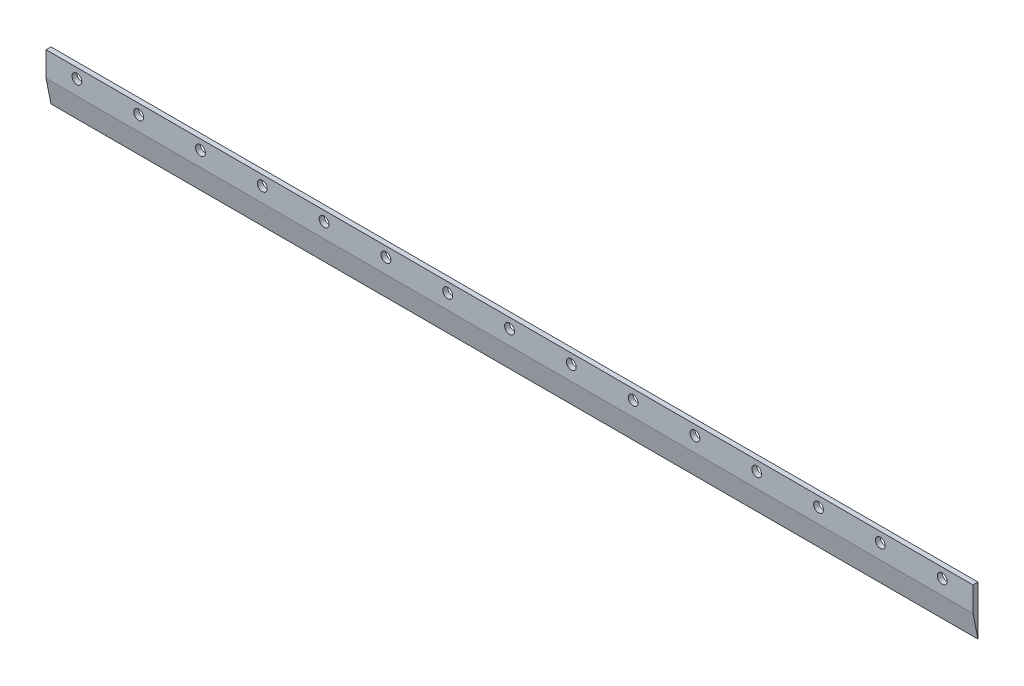
ISO-10303-21;
HEADER;
FILE_DESCRIPTION(('STEP AP214'),'2;1');
FILE_NAME('part.step','',(''),(''),'','','');
FILE_SCHEMA(('AUTOMOTIVE_DESIGN { 1 0 10303 214 1 1 1 1 }'));
ENDSEC;
DATA;
#1=APPLICATION_CONTEXT('core data for automotive mechanical design processes');
#2=APPLICATION_PROTOCOL_DEFINITION('international standard','automotive_design',2000,#1);
#3=PRODUCT_CONTEXT('',#1,'mechanical');
#4=PRODUCT('Part','Part','',(#3));
#5=PRODUCT_RELATED_PRODUCT_CATEGORY('part','',(#4));
#6=PRODUCT_DEFINITION_FORMATION('','',#4);
#7=PRODUCT_DEFINITION_CONTEXT('part definition',#1,'design');
#8=PRODUCT_DEFINITION('design','',#6,#7);
#9=PRODUCT_DEFINITION_SHAPE('','',#8);
#10=(LENGTH_UNIT() NAMED_UNIT(*) SI_UNIT(.MILLI.,.METRE.));
#11=(NAMED_UNIT(*) PLANE_ANGLE_UNIT() SI_UNIT($,.RADIAN.));
#12=(NAMED_UNIT(*) SI_UNIT($,.STERADIAN.) SOLID_ANGLE_UNIT());
#13=UNCERTAINTY_MEASURE_WITH_UNIT(LENGTH_MEASURE(1.E-05),#10,'distance_accuracy_value','');
#14=(GEOMETRIC_REPRESENTATION_CONTEXT(3) GLOBAL_UNCERTAINTY_ASSIGNED_CONTEXT((#13)) GLOBAL_UNIT_ASSIGNED_CONTEXT((#10,
#11,#12)) REPRESENTATION_CONTEXT('',''));
#15=CARTESIAN_POINT('',(0.,0.,0.));
#16=DIRECTION('',(0.,0.,1.));
#17=DIRECTION('',(1.,0.,0.));
#18=AXIS2_PLACEMENT_3D('',#15,#16,#17);
#19=CARTESIAN_POINT('',(375.,-20.,4.));
#20=DIRECTION('',(-1.,0.,0.));
#21=DIRECTION('',(0.,0.,1.));
#22=AXIS2_PLACEMENT_3D('',#19,#20,#21);
#23=PLANE('',#22);
#24=DIRECTION('',(0.,1.,0.));
#25=VECTOR('',#24,1.);
#26=CARTESIAN_POINT('',(375.,-20.,4.));
#27=LINE('',#26,#25);
#28=CARTESIAN_POINT('',(375.,0.,4.));
#29=VERTEX_POINT('',#28);
#30=CARTESIAN_POINT('',(375.,20.,4.));
#31=VERTEX_POINT('',#30);
#32=EDGE_CURVE('E91',#29,#31,#27,.T.);
#33=ORIENTED_EDGE('',*,*,#32,.F.);
#34=DIRECTION('',(0.,0.98058067569092,0.196116135138184));
#35=VECTOR('',#34,1.);
#36=CARTESIAN_POINT('',(375.,-0.769230769230769,3.84615384615385));
#37=LINE('',#36,#35);
#38=CARTESIAN_POINT('',(375.,-20.,0.));
#39=VERTEX_POINT('',#38);
#40=EDGE_CURVE('E80',#39,#29,#37,.T.);
#41=ORIENTED_EDGE('',*,*,#40,.F.);
#42=DIRECTION('',(0.,1.,0.));
#43=VECTOR('',#42,1.);
#44=CARTESIAN_POINT('',(375.,-20.,0.));
#45=LINE('',#44,#43);
#46=CARTESIAN_POINT('',(375.,20.,0.));
#47=VERTEX_POINT('',#46);
#48=EDGE_CURVE('E90',#39,#47,#45,.T.);
#49=ORIENTED_EDGE('',*,*,#48,.T.);
#50=DIRECTION('',(0.,0.,-1.));
#51=VECTOR('',#50,1.);
#52=CARTESIAN_POINT('',(375.,20.,4.));
#53=LINE('',#52,#51);
#54=EDGE_CURVE('E11',#31,#47,#53,.T.);
#55=ORIENTED_EDGE('',*,*,#54,.F.);
#56=EDGE_LOOP('',(#33,#41,#49,#55));
#57=FACE_BOUND('',#56,.T.);
#58=ADVANCED_FACE('F34',(#57),#23,.F.);
#59=CARTESIAN_POINT('',(-375.,20.,4.));
#60=DIRECTION('',(0.,-1.,0.));
#61=DIRECTION('',(0.,0.,-1.));
#62=AXIS2_PLACEMENT_3D('',#59,#60,#61);
#63=PLANE('',#62);
#64=DIRECTION('',(-1.,0.,0.));
#65=VECTOR('',#64,1.);
#66=CARTESIAN_POINT('',(-375.,20.,0.));
#67=LINE('',#66,#65);
#68=CARTESIAN_POINT('',(-375.,20.,0.));
#69=VERTEX_POINT('',#68);
#70=EDGE_CURVE('E61',#47,#69,#67,.T.);
#71=ORIENTED_EDGE('',*,*,#70,.T.);
#72=DIRECTION('',(0.,0.,-1.));
#73=VECTOR('',#72,1.);
#74=CARTESIAN_POINT('',(-375.,20.,4.));
#75=LINE('',#74,#73);
#76=CARTESIAN_POINT('',(-375.,20.,4.));
#77=VERTEX_POINT('',#76);
#78=EDGE_CURVE('E42',#77,#69,#75,.T.);
#79=ORIENTED_EDGE('',*,*,#78,.F.);
#80=DIRECTION('',(-1.,0.,0.));
#81=VECTOR('',#80,1.);
#82=CARTESIAN_POINT('',(-375.,20.,4.));
#83=LINE('',#82,#81);
#84=EDGE_CURVE('E50',#31,#77,#83,.T.);
#85=ORIENTED_EDGE('',*,*,#84,.F.);
#86=ORIENTED_EDGE('',*,*,#54,.T.);
#87=EDGE_LOOP('',(#71,#79,#85,#86));
#88=FACE_BOUND('',#87,.T.);
#89=ADVANCED_FACE('F245',(#88),#63,.F.);
#90=CARTESIAN_POINT('',(-375.,-20.,4.));
#91=DIRECTION('',(1.,0.,0.));
#92=DIRECTION('',(0.,0.,-1.));
#93=AXIS2_PLACEMENT_3D('',#90,#91,#92);
#94=PLANE('',#93);
#95=DIRECTION('',(0.,-1.,0.));
#96=VECTOR('',#95,1.);
#97=CARTESIAN_POINT('',(-375.,-20.,0.));
#98=LINE('',#97,#96);
#99=CARTESIAN_POINT('',(-375.,-20.,0.));
#100=VERTEX_POINT('',#99);
#101=EDGE_CURVE('E83',#69,#100,#98,.T.);
#102=ORIENTED_EDGE('',*,*,#101,.T.);
#103=DIRECTION('',(0.,0.98058067569092,0.196116135138184));
#104=VECTOR('',#103,1.);
#105=CARTESIAN_POINT('',(-375.,-0.769230769230769,3.84615384615385));
#106=LINE('',#105,#104);
#107=CARTESIAN_POINT('',(-375.,0.,4.));
#108=VERTEX_POINT('',#107);
#109=EDGE_CURVE('E68',#100,#108,#106,.T.);
#110=ORIENTED_EDGE('',*,*,#109,.T.);
#111=DIRECTION('',(0.,-1.,0.));
#112=VECTOR('',#111,1.);
#113=CARTESIAN_POINT('',(-375.,-20.,4.));
#114=LINE('',#113,#112);
#115=EDGE_CURVE('E95',#77,#108,#114,.T.);
#116=ORIENTED_EDGE('',*,*,#115,.F.);
#117=ORIENTED_EDGE('',*,*,#78,.T.);
#118=EDGE_LOOP('',(#102,#110,#116,#117));
#119=FACE_BOUND('',#118,.T.);
#120=ADVANCED_FACE('F84',(#119),#94,.F.);
#121=CARTESIAN_POINT('',(0.,0.,4.));
#122=DIRECTION('',(0.,0.,-1.));
#123=DIRECTION('',(-1.,0.,0.));
#124=AXIS2_PLACEMENT_3D('',#121,#122,#123);
#125=PLANE('',#124);
#126=CARTESIAN_POINT('',(350.,11.9999999999999,4.));
#127=DIRECTION('',(0.,0.,-1.));
#128=DIRECTION('',(-1.,0.,0.));
#129=AXIS2_PLACEMENT_3D('',#126,#127,#128);
#130=CIRCLE('',#129,3.96875000000005);
#131=CARTESIAN_POINT('',(346.03125,11.9999999999999,4.));
#132=VERTEX_POINT('',#131);
#133=EDGE_CURVE('E105',#132,#132,#130,.T.);
#134=ORIENTED_EDGE('',*,*,#133,.T.);
#135=EDGE_LOOP('',(#134));
#136=FACE_BOUND('',#135,.T.);
#137=CARTESIAN_POINT('',(300.,11.9999999999999,4.));
#138=DIRECTION('',(0.,0.,-1.));
#139=DIRECTION('',(-1.,0.,0.));
#140=AXIS2_PLACEMENT_3D('',#137,#138,#139);
#141=CIRCLE('',#140,3.96875000000005);
#142=CARTESIAN_POINT('',(296.03125,11.9999999999999,4.));
#143=VERTEX_POINT('',#142);
#144=EDGE_CURVE('E109',#143,#143,#141,.T.);
#145=ORIENTED_EDGE('',*,*,#144,.T.);
#146=EDGE_LOOP('',(#145));
#147=FACE_BOUND('',#146,.T.);
#148=CARTESIAN_POINT('',(250.,11.9999999999999,4.));
#149=DIRECTION('',(0.,0.,-1.));
#150=DIRECTION('',(-1.,0.,0.));
#151=AXIS2_PLACEMENT_3D('',#148,#149,#150);
#152=CIRCLE('',#151,3.96875000000005);
#153=CARTESIAN_POINT('',(246.03125,11.9999999999999,4.));
#154=VERTEX_POINT('',#153);
#155=EDGE_CURVE('E112',#154,#154,#152,.T.);
#156=ORIENTED_EDGE('',*,*,#155,.T.);
#157=EDGE_LOOP('',(#156));
#158=FACE_BOUND('',#157,.T.);
#159=CARTESIAN_POINT('',(200.,11.9999999999999,4.));
#160=DIRECTION('',(0.,0.,-1.));
#161=DIRECTION('',(-1.,0.,0.));
#162=AXIS2_PLACEMENT_3D('',#159,#160,#161);
#163=CIRCLE('',#162,3.96875000000005);
#164=CARTESIAN_POINT('',(196.03125,11.9999999999999,4.));
#165=VERTEX_POINT('',#164);
#166=EDGE_CURVE('E115',#165,#165,#163,.T.);
#167=ORIENTED_EDGE('',*,*,#166,.T.);
#168=EDGE_LOOP('',(#167));
#169=FACE_BOUND('',#168,.T.);
#170=CARTESIAN_POINT('',(150.,11.9999999999999,4.));
#171=DIRECTION('',(0.,0.,-1.));
#172=DIRECTION('',(-1.,0.,0.));
#173=AXIS2_PLACEMENT_3D('',#170,#171,#172);
#174=CIRCLE('',#173,3.96875000000005);
#175=CARTESIAN_POINT('',(146.03125,11.9999999999999,4.));
#176=VERTEX_POINT('',#175);
#177=EDGE_CURVE('E118',#176,#176,#174,.T.);
#178=ORIENTED_EDGE('',*,*,#177,.T.);
#179=EDGE_LOOP('',(#178));
#180=FACE_BOUND('',#179,.T.);
#181=CARTESIAN_POINT('',(100.,11.9999999999999,4.));
#182=DIRECTION('',(0.,0.,-1.));
#183=DIRECTION('',(-1.,0.,0.));
#184=AXIS2_PLACEMENT_3D('',#181,#182,#183);
#185=CIRCLE('',#184,3.96875000000005);
#186=CARTESIAN_POINT('',(96.0312499999999,11.9999999999999,4.));
#187=VERTEX_POINT('',#186);
#188=EDGE_CURVE('E121',#187,#187,#185,.T.);
#189=ORIENTED_EDGE('',*,*,#188,.T.);
#190=EDGE_LOOP('',(#189));
#191=FACE_BOUND('',#190,.T.);
#192=CARTESIAN_POINT('',(50.,11.9999999999999,4.));
#193=DIRECTION('',(0.,0.,-1.));
#194=DIRECTION('',(-1.,0.,0.));
#195=AXIS2_PLACEMENT_3D('',#192,#193,#194);
#196=CIRCLE('',#195,3.96875000000004);
#197=CARTESIAN_POINT('',(46.03125,11.9999999999999,4.));
#198=VERTEX_POINT('',#197);
#199=EDGE_CURVE('E124',#198,#198,#196,.T.);
#200=ORIENTED_EDGE('',*,*,#199,.T.);
#201=EDGE_LOOP('',(#200));
#202=FACE_BOUND('',#201,.T.);
#203=CARTESIAN_POINT('',(0.,11.9999999999999,4.));
#204=DIRECTION('',(0.,0.,-1.));
#205=DIRECTION('',(-1.,0.,0.));
#206=AXIS2_PLACEMENT_3D('',#203,#204,#205);
#207=CIRCLE('',#206,3.96875000000004);
#208=CARTESIAN_POINT('',(-3.96875000000004,11.9999999999999,4.));
#209=VERTEX_POINT('',#208);
#210=EDGE_CURVE('E127',#209,#209,#207,.T.);
#211=ORIENTED_EDGE('',*,*,#210,.T.);
#212=EDGE_LOOP('',(#211));
#213=FACE_BOUND('',#212,.T.);
#214=CARTESIAN_POINT('',(-50.,11.9999999999999,4.));
#215=DIRECTION('',(0.,0.,-1.));
#216=DIRECTION('',(-1.,0.,0.));
#217=AXIS2_PLACEMENT_3D('',#214,#215,#216);
#218=CIRCLE('',#217,3.96875000000005);
#219=CARTESIAN_POINT('',(-53.96875,11.9999999999999,4.));
#220=VERTEX_POINT('',#219);
#221=EDGE_CURVE('E130',#220,#220,#218,.T.);
#222=ORIENTED_EDGE('',*,*,#221,.T.);
#223=EDGE_LOOP('',(#222));
#224=FACE_BOUND('',#223,.T.);
#225=CARTESIAN_POINT('',(-100.,11.9999999999999,4.));
#226=DIRECTION('',(0.,0.,-1.));
#227=DIRECTION('',(-1.,0.,0.));
#228=AXIS2_PLACEMENT_3D('',#225,#226,#227);
#229=CIRCLE('',#228,3.96875000000005);
#230=CARTESIAN_POINT('',(-103.96875,11.9999999999999,4.));
#231=VERTEX_POINT('',#230);
#232=EDGE_CURVE('E133',#231,#231,#229,.T.);
#233=ORIENTED_EDGE('',*,*,#232,.T.);
#234=EDGE_LOOP('',(#233));
#235=FACE_BOUND('',#234,.T.);
#236=CARTESIAN_POINT('',(-150.,11.9999999999999,4.));
#237=DIRECTION('',(0.,0.,-1.));
#238=DIRECTION('',(-1.,0.,0.));
#239=AXIS2_PLACEMENT_3D('',#236,#237,#238);
#240=CIRCLE('',#239,3.96875000000005);
#241=CARTESIAN_POINT('',(-153.96875,11.9999999999999,4.));
#242=VERTEX_POINT('',#241);
#243=EDGE_CURVE('E136',#242,#242,#240,.T.);
#244=ORIENTED_EDGE('',*,*,#243,.T.);
#245=EDGE_LOOP('',(#244));
#246=FACE_BOUND('',#245,.T.);
#247=CARTESIAN_POINT('',(-200.,11.9999999999999,4.));
#248=DIRECTION('',(0.,0.,-1.));
#249=DIRECTION('',(-1.,0.,0.));
#250=AXIS2_PLACEMENT_3D('',#247,#248,#249);
#251=CIRCLE('',#250,3.96875000000005);
#252=CARTESIAN_POINT('',(-203.96875,11.9999999999999,4.));
#253=VERTEX_POINT('',#252);
#254=EDGE_CURVE('E139',#253,#253,#251,.T.);
#255=ORIENTED_EDGE('',*,*,#254,.T.);
#256=EDGE_LOOP('',(#255));
#257=FACE_BOUND('',#256,.T.);
#258=CARTESIAN_POINT('',(-250.,11.9999999999999,4.));
#259=DIRECTION('',(0.,0.,-1.));
#260=DIRECTION('',(-1.,0.,0.));
#261=AXIS2_PLACEMENT_3D('',#258,#259,#260);
#262=CIRCLE('',#261,3.96875000000005);
#263=CARTESIAN_POINT('',(-253.96875,11.9999999999999,4.));
#264=VERTEX_POINT('',#263);
#265=EDGE_CURVE('E142',#264,#264,#262,.T.);
#266=ORIENTED_EDGE('',*,*,#265,.T.);
#267=EDGE_LOOP('',(#266));
#268=FACE_BOUND('',#267,.T.);
#269=CARTESIAN_POINT('',(-300.,11.9999999999999,4.));
#270=DIRECTION('',(0.,0.,-1.));
#271=DIRECTION('',(-1.,0.,0.));
#272=AXIS2_PLACEMENT_3D('',#269,#270,#271);
#273=CIRCLE('',#272,3.96875000000005);
#274=CARTESIAN_POINT('',(-303.96875,11.9999999999999,4.));
#275=VERTEX_POINT('',#274);
#276=EDGE_CURVE('E145',#275,#275,#273,.T.);
#277=ORIENTED_EDGE('',*,*,#276,.T.);
#278=EDGE_LOOP('',(#277));
#279=FACE_BOUND('',#278,.T.);
#280=CARTESIAN_POINT('',(-350.,11.9999999999999,4.));
#281=DIRECTION('',(0.,0.,-1.));
#282=DIRECTION('',(-1.,0.,0.));
#283=AXIS2_PLACEMENT_3D('',#280,#281,#282);
#284=CIRCLE('',#283,3.96875000000005);
#285=CARTESIAN_POINT('',(-353.96875,11.9999999999999,4.));
#286=VERTEX_POINT('',#285);
#287=EDGE_CURVE('E148',#286,#286,#284,.T.);
#288=ORIENTED_EDGE('',*,*,#287,.T.);
#289=EDGE_LOOP('',(#288));
#290=FACE_BOUND('',#289,.T.);
#291=ORIENTED_EDGE('',*,*,#115,.T.);
#292=DIRECTION('',(1.,0.,0.));
#293=VECTOR('',#292,1.);
#294=CARTESIAN_POINT('',(-375.,0.,4.));
#295=LINE('',#294,#293);
#296=EDGE_CURVE('E77',#108,#29,#295,.T.);
#297=ORIENTED_EDGE('',*,*,#296,.T.);
#298=ORIENTED_EDGE('',*,*,#32,.T.);
#299=ORIENTED_EDGE('',*,*,#84,.T.);
#300=EDGE_LOOP('',(#291,#297,#298,#299));
#301=FACE_BOUND('',#300,.T.);
#302=ADVANCED_FACE('F202',(#136,#147,#158,#169,#180,#191,#202,#213,#224,#235,#246,#257,#268,
#279,#290,#301),#125,.F.);
#303=CARTESIAN_POINT('',(0.,0.,0.));
#304=DIRECTION('',(0.,0.,-1.));
#305=DIRECTION('',(-1.,0.,0.));
#306=AXIS2_PLACEMENT_3D('',#303,#304,#305);
#307=PLANE('',#306);
#308=CARTESIAN_POINT('',(350.,11.9999999999999,0.));
#309=DIRECTION('',(0.,0.,-1.));
#310=DIRECTION('',(-1.,0.,0.));
#311=AXIS2_PLACEMENT_3D('',#308,#309,#310);
#312=CIRCLE('',#311,3.96875000000005);
#313=CARTESIAN_POINT('',(346.03125,11.9999999999999,0.));
#314=VERTEX_POINT('',#313);
#315=EDGE_CURVE('E151',#314,#314,#312,.T.);
#316=ORIENTED_EDGE('',*,*,#315,.F.);
#317=EDGE_LOOP('',(#316));
#318=FACE_BOUND('',#317,.T.);
#319=CARTESIAN_POINT('',(300.,11.9999999999999,0.));
#320=DIRECTION('',(0.,0.,-1.));
#321=DIRECTION('',(-1.,0.,0.));
#322=AXIS2_PLACEMENT_3D('',#319,#320,#321);
#323=CIRCLE('',#322,3.96875000000005);
#324=CARTESIAN_POINT('',(296.03125,11.9999999999999,0.));
#325=VERTEX_POINT('',#324);
#326=EDGE_CURVE('E191',#325,#325,#323,.T.);
#327=ORIENTED_EDGE('',*,*,#326,.F.);
#328=EDGE_LOOP('',(#327));
#329=FACE_BOUND('',#328,.T.);
#330=CARTESIAN_POINT('',(250.,11.9999999999999,0.));
#331=DIRECTION('',(0.,0.,-1.));
#332=DIRECTION('',(-1.,0.,0.));
#333=AXIS2_PLACEMENT_3D('',#330,#331,#332);
#334=CIRCLE('',#333,3.96875000000005);
#335=CARTESIAN_POINT('',(246.03125,11.9999999999999,0.));
#336=VERTEX_POINT('',#335);
#337=EDGE_CURVE('E188',#336,#336,#334,.T.);
#338=ORIENTED_EDGE('',*,*,#337,.F.);
#339=EDGE_LOOP('',(#338));
#340=FACE_BOUND('',#339,.T.);
#341=CARTESIAN_POINT('',(200.,11.9999999999999,0.));
#342=DIRECTION('',(0.,0.,-1.));
#343=DIRECTION('',(-1.,0.,0.));
#344=AXIS2_PLACEMENT_3D('',#341,#342,#343);
#345=CIRCLE('',#344,3.96875000000005);
#346=CARTESIAN_POINT('',(196.03125,11.9999999999999,0.));
#347=VERTEX_POINT('',#346);
#348=EDGE_CURVE('E185',#347,#347,#345,.T.);
#349=ORIENTED_EDGE('',*,*,#348,.F.);
#350=EDGE_LOOP('',(#349));
#351=FACE_BOUND('',#350,.T.);
#352=CARTESIAN_POINT('',(150.,11.9999999999999,0.));
#353=DIRECTION('',(0.,0.,-1.));
#354=DIRECTION('',(-1.,0.,0.));
#355=AXIS2_PLACEMENT_3D('',#352,#353,#354);
#356=CIRCLE('',#355,3.96875000000005);
#357=CARTESIAN_POINT('',(146.03125,11.9999999999999,0.));
#358=VERTEX_POINT('',#357);
#359=EDGE_CURVE('E182',#358,#358,#356,.T.);
#360=ORIENTED_EDGE('',*,*,#359,.F.);
#361=EDGE_LOOP('',(#360));
#362=FACE_BOUND('',#361,.T.);
#363=CARTESIAN_POINT('',(100.,11.9999999999999,0.));
#364=DIRECTION('',(0.,0.,-1.));
#365=DIRECTION('',(-1.,0.,0.));
#366=AXIS2_PLACEMENT_3D('',#363,#364,#365);
#367=CIRCLE('',#366,3.96875000000005);
#368=CARTESIAN_POINT('',(96.0312499999999,11.9999999999999,0.));
#369=VERTEX_POINT('',#368);
#370=EDGE_CURVE('E179',#369,#369,#367,.T.);
#371=ORIENTED_EDGE('',*,*,#370,.F.);
#372=EDGE_LOOP('',(#371));
#373=FACE_BOUND('',#372,.T.);
#374=CARTESIAN_POINT('',(50.,11.9999999999999,0.));
#375=DIRECTION('',(0.,0.,-1.));
#376=DIRECTION('',(-1.,0.,0.));
#377=AXIS2_PLACEMENT_3D('',#374,#375,#376);
#378=CIRCLE('',#377,3.96875000000004);
#379=CARTESIAN_POINT('',(46.03125,11.9999999999999,0.));
#380=VERTEX_POINT('',#379);
#381=EDGE_CURVE('E176',#380,#380,#378,.T.);
#382=ORIENTED_EDGE('',*,*,#381,.F.);
#383=EDGE_LOOP('',(#382));
#384=FACE_BOUND('',#383,.T.);
#385=CARTESIAN_POINT('',(0.,11.9999999999999,0.));
#386=DIRECTION('',(0.,0.,-1.));
#387=DIRECTION('',(-1.,0.,0.));
#388=AXIS2_PLACEMENT_3D('',#385,#386,#387);
#389=CIRCLE('',#388,3.96875000000004);
#390=CARTESIAN_POINT('',(-3.96875000000004,11.9999999999999,0.));
#391=VERTEX_POINT('',#390);
#392=EDGE_CURVE('E173',#391,#391,#389,.T.);
#393=ORIENTED_EDGE('',*,*,#392,.F.);
#394=EDGE_LOOP('',(#393));
#395=FACE_BOUND('',#394,.T.);
#396=CARTESIAN_POINT('',(-50.,11.9999999999999,0.));
#397=DIRECTION('',(0.,0.,-1.));
#398=DIRECTION('',(-1.,0.,0.));
#399=AXIS2_PLACEMENT_3D('',#396,#397,#398);
#400=CIRCLE('',#399,3.96875000000005);
#401=CARTESIAN_POINT('',(-53.96875,11.9999999999999,0.));
#402=VERTEX_POINT('',#401);
#403=EDGE_CURVE('E170',#402,#402,#400,.T.);
#404=ORIENTED_EDGE('',*,*,#403,.F.);
#405=EDGE_LOOP('',(#404));
#406=FACE_BOUND('',#405,.T.);
#407=CARTESIAN_POINT('',(-100.,11.9999999999999,0.));
#408=DIRECTION('',(0.,0.,-1.));
#409=DIRECTION('',(-1.,0.,0.));
#410=AXIS2_PLACEMENT_3D('',#407,#408,#409);
#411=CIRCLE('',#410,3.96875000000005);
#412=CARTESIAN_POINT('',(-103.96875,11.9999999999999,0.));
#413=VERTEX_POINT('',#412);
#414=EDGE_CURVE('E167',#413,#413,#411,.T.);
#415=ORIENTED_EDGE('',*,*,#414,.F.);
#416=EDGE_LOOP('',(#415));
#417=FACE_BOUND('',#416,.T.);
#418=CARTESIAN_POINT('',(-150.,11.9999999999999,0.));
#419=DIRECTION('',(0.,0.,-1.));
#420=DIRECTION('',(-1.,0.,0.));
#421=AXIS2_PLACEMENT_3D('',#418,#419,#420);
#422=CIRCLE('',#421,3.96875000000005);
#423=CARTESIAN_POINT('',(-153.96875,11.9999999999999,0.));
#424=VERTEX_POINT('',#423);
#425=EDGE_CURVE('E164',#424,#424,#422,.T.);
#426=ORIENTED_EDGE('',*,*,#425,.F.);
#427=EDGE_LOOP('',(#426));
#428=FACE_BOUND('',#427,.T.);
#429=CARTESIAN_POINT('',(-200.,11.9999999999999,0.));
#430=DIRECTION('',(0.,0.,-1.));
#431=DIRECTION('',(-1.,0.,0.));
#432=AXIS2_PLACEMENT_3D('',#429,#430,#431);
#433=CIRCLE('',#432,3.96875000000005);
#434=CARTESIAN_POINT('',(-203.96875,11.9999999999999,0.));
#435=VERTEX_POINT('',#434);
#436=EDGE_CURVE('E161',#435,#435,#433,.T.);
#437=ORIENTED_EDGE('',*,*,#436,.F.);
#438=EDGE_LOOP('',(#437));
#439=FACE_BOUND('',#438,.T.);
#440=CARTESIAN_POINT('',(-250.,11.9999999999999,0.));
#441=DIRECTION('',(0.,0.,-1.));
#442=DIRECTION('',(-1.,0.,0.));
#443=AXIS2_PLACEMENT_3D('',#440,#441,#442);
#444=CIRCLE('',#443,3.96875000000005);
#445=CARTESIAN_POINT('',(-253.96875,11.9999999999999,0.));
#446=VERTEX_POINT('',#445);
#447=EDGE_CURVE('E158',#446,#446,#444,.T.);
#448=ORIENTED_EDGE('',*,*,#447,.F.);
#449=EDGE_LOOP('',(#448));
#450=FACE_BOUND('',#449,.T.);
#451=CARTESIAN_POINT('',(-300.,11.9999999999999,0.));
#452=DIRECTION('',(0.,0.,-1.));
#453=DIRECTION('',(-1.,0.,0.));
#454=AXIS2_PLACEMENT_3D('',#451,#452,#453);
#455=CIRCLE('',#454,3.96875000000005);
#456=CARTESIAN_POINT('',(-303.96875,11.9999999999999,0.));
#457=VERTEX_POINT('',#456);
#458=EDGE_CURVE('E155',#457,#457,#455,.T.);
#459=ORIENTED_EDGE('',*,*,#458,.F.);
#460=EDGE_LOOP('',(#459));
#461=FACE_BOUND('',#460,.T.);
#462=CARTESIAN_POINT('',(-350.,11.9999999999999,0.));
#463=DIRECTION('',(0.,0.,-1.));
#464=DIRECTION('',(-1.,0.,0.));
#465=AXIS2_PLACEMENT_3D('',#462,#463,#464);
#466=CIRCLE('',#465,3.96875000000005);
#467=CARTESIAN_POINT('',(-353.96875,11.9999999999999,0.));
#468=VERTEX_POINT('',#467);
#469=EDGE_CURVE('E152',#468,#468,#466,.T.);
#470=ORIENTED_EDGE('',*,*,#469,.F.);
#471=EDGE_LOOP('',(#470));
#472=FACE_BOUND('',#471,.T.);
#473=ORIENTED_EDGE('',*,*,#48,.F.);
#474=DIRECTION('',(1.,0.,0.));
#475=VECTOR('',#474,1.);
#476=CARTESIAN_POINT('',(-375.,-20.,0.));
#477=LINE('',#476,#475);
#478=EDGE_CURVE('E74',#100,#39,#477,.T.);
#479=ORIENTED_EDGE('',*,*,#478,.F.);
#480=ORIENTED_EDGE('',*,*,#101,.F.);
#481=ORIENTED_EDGE('',*,*,#70,.F.);
#482=EDGE_LOOP('',(#473,#479,#480,#481));
#483=FACE_BOUND('',#482,.T.);
#484=ADVANCED_FACE('F88',(#318,#329,#340,#351,#362,#373,#384,#395,#406,#417,#428,#439,#450,#461,
#472,#483),#307,.T.);
#485=CARTESIAN_POINT('',(-375.,-0.769230769230769,3.84615384615385));
#486=DIRECTION('',(0.,0.196116135138184,-0.98058067569092));
#487=DIRECTION('',(0.,0.98058067569092,0.196116135138184));
#488=AXIS2_PLACEMENT_3D('',#485,#486,#487);
#489=PLANE('',#488);
#490=ORIENTED_EDGE('',*,*,#40,.T.);
#491=ORIENTED_EDGE('',*,*,#296,.F.);
#492=ORIENTED_EDGE('',*,*,#109,.F.);
#493=ORIENTED_EDGE('',*,*,#478,.T.);
#494=EDGE_LOOP('',(#490,#491,#492,#493));
#495=FACE_BOUND('',#494,.T.);
#496=ADVANCED_FACE('F71',(#495),#489,.F.);
#497=CARTESIAN_POINT('',(-350.,11.9999999999999,10.));
#498=DIRECTION('',(0.,0.,-1.));
#499=DIRECTION('',(-1.,0.,0.));
#500=AXIS2_PLACEMENT_3D('',#497,#498,#499);
#501=CYLINDRICAL_SURFACE('',#500,3.96875000000005);
#502=ORIENTED_EDGE('',*,*,#469,.T.);
#503=EDGE_LOOP('',(#502));
#504=FACE_BOUND('',#503,.T.);
#505=ORIENTED_EDGE('',*,*,#287,.F.);
#506=EDGE_LOOP('',(#505));
#507=FACE_BOUND('',#506,.T.);
#508=ADVANCED_FACE('F232',(#504,#507),#501,.F.);
#509=CARTESIAN_POINT('',(-300.,11.9999999999999,10.));
#510=DIRECTION('',(0.,0.,-1.));
#511=DIRECTION('',(-1.,0.,0.));
#512=AXIS2_PLACEMENT_3D('',#509,#510,#511);
#513=CYLINDRICAL_SURFACE('',#512,3.96875000000005);
#514=ORIENTED_EDGE('',*,*,#458,.T.);
#515=EDGE_LOOP('',(#514));
#516=FACE_BOUND('',#515,.T.);
#517=ORIENTED_EDGE('',*,*,#276,.F.);
#518=EDGE_LOOP('',(#517));
#519=FACE_BOUND('',#518,.T.);
#520=ADVANCED_FACE('F235',(#516,#519),#513,.F.);
#521=CARTESIAN_POINT('',(-250.,11.9999999999999,10.));
#522=DIRECTION('',(0.,0.,-1.));
#523=DIRECTION('',(-1.,0.,0.));
#524=AXIS2_PLACEMENT_3D('',#521,#522,#523);
#525=CYLINDRICAL_SURFACE('',#524,3.96875000000005);
#526=ORIENTED_EDGE('',*,*,#447,.T.);
#527=EDGE_LOOP('',(#526));
#528=FACE_BOUND('',#527,.T.);
#529=ORIENTED_EDGE('',*,*,#265,.F.);
#530=EDGE_LOOP('',(#529));
#531=FACE_BOUND('',#530,.T.);
#532=ADVANCED_FACE('F295',(#528,#531),#525,.F.);
#533=CARTESIAN_POINT('',(-200.,11.9999999999999,10.));
#534=DIRECTION('',(0.,0.,-1.));
#535=DIRECTION('',(-1.,0.,0.));
#536=AXIS2_PLACEMENT_3D('',#533,#534,#535);
#537=CYLINDRICAL_SURFACE('',#536,3.96875000000005);
#538=ORIENTED_EDGE('',*,*,#436,.T.);
#539=EDGE_LOOP('',(#538));
#540=FACE_BOUND('',#539,.T.);
#541=ORIENTED_EDGE('',*,*,#254,.F.);
#542=EDGE_LOOP('',(#541));
#543=FACE_BOUND('',#542,.T.);
#544=ADVANCED_FACE('F305',(#540,#543),#537,.F.);
#545=CARTESIAN_POINT('',(-150.,11.9999999999999,10.));
#546=DIRECTION('',(0.,0.,-1.));
#547=DIRECTION('',(-1.,0.,0.));
#548=AXIS2_PLACEMENT_3D('',#545,#546,#547);
#549=CYLINDRICAL_SURFACE('',#548,3.96875000000005);
#550=ORIENTED_EDGE('',*,*,#425,.T.);
#551=EDGE_LOOP('',(#550));
#552=FACE_BOUND('',#551,.T.);
#553=ORIENTED_EDGE('',*,*,#243,.F.);
#554=EDGE_LOOP('',(#553));
#555=FACE_BOUND('',#554,.T.);
#556=ADVANCED_FACE('F315',(#552,#555),#549,.F.);
#557=CARTESIAN_POINT('',(-100.,11.9999999999999,10.));
#558=DIRECTION('',(0.,0.,-1.));
#559=DIRECTION('',(-1.,0.,0.));
#560=AXIS2_PLACEMENT_3D('',#557,#558,#559);
#561=CYLINDRICAL_SURFACE('',#560,3.96875000000005);
#562=ORIENTED_EDGE('',*,*,#414,.T.);
#563=EDGE_LOOP('',(#562));
#564=FACE_BOUND('',#563,.T.);
#565=ORIENTED_EDGE('',*,*,#232,.F.);
#566=EDGE_LOOP('',(#565));
#567=FACE_BOUND('',#566,.T.);
#568=ADVANCED_FACE('F325',(#564,#567),#561,.F.);
#569=CARTESIAN_POINT('',(-50.,11.9999999999999,10.));
#570=DIRECTION('',(0.,0.,-1.));
#571=DIRECTION('',(-1.,0.,0.));
#572=AXIS2_PLACEMENT_3D('',#569,#570,#571);
#573=CYLINDRICAL_SURFACE('',#572,3.96875000000005);
#574=ORIENTED_EDGE('',*,*,#403,.T.);
#575=EDGE_LOOP('',(#574));
#576=FACE_BOUND('',#575,.T.);
#577=ORIENTED_EDGE('',*,*,#221,.F.);
#578=EDGE_LOOP('',(#577));
#579=FACE_BOUND('',#578,.T.);
#580=ADVANCED_FACE('F335',(#576,#579),#573,.F.);
#581=CARTESIAN_POINT('',(0.,11.9999999999999,10.));
#582=DIRECTION('',(0.,0.,-1.));
#583=DIRECTION('',(-1.,0.,0.));
#584=AXIS2_PLACEMENT_3D('',#581,#582,#583);
#585=CYLINDRICAL_SURFACE('',#584,3.96875000000004);
#586=ORIENTED_EDGE('',*,*,#392,.T.);
#587=EDGE_LOOP('',(#586));
#588=FACE_BOUND('',#587,.T.);
#589=ORIENTED_EDGE('',*,*,#210,.F.);
#590=EDGE_LOOP('',(#589));
#591=FACE_BOUND('',#590,.T.);
#592=ADVANCED_FACE('F345',(#588,#591),#585,.F.);
#593=CARTESIAN_POINT('',(50.,11.9999999999999,10.));
#594=DIRECTION('',(0.,0.,-1.));
#595=DIRECTION('',(-1.,0.,0.));
#596=AXIS2_PLACEMENT_3D('',#593,#594,#595);
#597=CYLINDRICAL_SURFACE('',#596,3.96875000000004);
#598=ORIENTED_EDGE('',*,*,#381,.T.);
#599=EDGE_LOOP('',(#598));
#600=FACE_BOUND('',#599,.T.);
#601=ORIENTED_EDGE('',*,*,#199,.F.);
#602=EDGE_LOOP('',(#601));
#603=FACE_BOUND('',#602,.T.);
#604=ADVANCED_FACE('F355',(#600,#603),#597,.F.);
#605=CARTESIAN_POINT('',(100.,11.9999999999999,10.));
#606=DIRECTION('',(0.,0.,-1.));
#607=DIRECTION('',(-1.,0.,0.));
#608=AXIS2_PLACEMENT_3D('',#605,#606,#607);
#609=CYLINDRICAL_SURFACE('',#608,3.96875000000005);
#610=ORIENTED_EDGE('',*,*,#370,.T.);
#611=EDGE_LOOP('',(#610));
#612=FACE_BOUND('',#611,.T.);
#613=ORIENTED_EDGE('',*,*,#188,.F.);
#614=EDGE_LOOP('',(#613));
#615=FACE_BOUND('',#614,.T.);
#616=ADVANCED_FACE('F365',(#612,#615),#609,.F.);
#617=CARTESIAN_POINT('',(150.,11.9999999999999,10.));
#618=DIRECTION('',(0.,0.,-1.));
#619=DIRECTION('',(-1.,0.,0.));
#620=AXIS2_PLACEMENT_3D('',#617,#618,#619);
#621=CYLINDRICAL_SURFACE('',#620,3.96875000000005);
#622=ORIENTED_EDGE('',*,*,#359,.T.);
#623=EDGE_LOOP('',(#622));
#624=FACE_BOUND('',#623,.T.);
#625=ORIENTED_EDGE('',*,*,#177,.F.);
#626=EDGE_LOOP('',(#625));
#627=FACE_BOUND('',#626,.T.);
#628=ADVANCED_FACE('F375',(#624,#627),#621,.F.);
#629=CARTESIAN_POINT('',(200.,11.9999999999999,10.));
#630=DIRECTION('',(0.,0.,-1.));
#631=DIRECTION('',(-1.,0.,0.));
#632=AXIS2_PLACEMENT_3D('',#629,#630,#631);
#633=CYLINDRICAL_SURFACE('',#632,3.96875000000005);
#634=ORIENTED_EDGE('',*,*,#348,.T.);
#635=EDGE_LOOP('',(#634));
#636=FACE_BOUND('',#635,.T.);
#637=ORIENTED_EDGE('',*,*,#166,.F.);
#638=EDGE_LOOP('',(#637));
#639=FACE_BOUND('',#638,.T.);
#640=ADVANCED_FACE('F385',(#636,#639),#633,.F.);
#641=CARTESIAN_POINT('',(250.,11.9999999999999,10.));
#642=DIRECTION('',(0.,0.,-1.));
#643=DIRECTION('',(-1.,0.,0.));
#644=AXIS2_PLACEMENT_3D('',#641,#642,#643);
#645=CYLINDRICAL_SURFACE('',#644,3.96875000000005);
#646=ORIENTED_EDGE('',*,*,#337,.T.);
#647=EDGE_LOOP('',(#646));
#648=FACE_BOUND('',#647,.T.);
#649=ORIENTED_EDGE('',*,*,#155,.F.);
#650=EDGE_LOOP('',(#649));
#651=FACE_BOUND('',#650,.T.);
#652=ADVANCED_FACE('F395',(#648,#651),#645,.F.);
#653=CARTESIAN_POINT('',(300.,11.9999999999999,10.));
#654=DIRECTION('',(0.,0.,-1.));
#655=DIRECTION('',(-1.,0.,0.));
#656=AXIS2_PLACEMENT_3D('',#653,#654,#655);
#657=CYLINDRICAL_SURFACE('',#656,3.96875000000005);
#658=ORIENTED_EDGE('',*,*,#326,.T.);
#659=EDGE_LOOP('',(#658));
#660=FACE_BOUND('',#659,.T.);
#661=ORIENTED_EDGE('',*,*,#144,.F.);
#662=EDGE_LOOP('',(#661));
#663=FACE_BOUND('',#662,.T.);
#664=ADVANCED_FACE('F405',(#660,#663),#657,.F.);
#665=CARTESIAN_POINT('',(350.,11.9999999999999,10.));
#666=DIRECTION('',(0.,0.,-1.));
#667=DIRECTION('',(-1.,0.,0.));
#668=AXIS2_PLACEMENT_3D('',#665,#666,#667);
#669=CYLINDRICAL_SURFACE('',#668,3.96875000000005);
#670=ORIENTED_EDGE('',*,*,#315,.T.);
#671=EDGE_LOOP('',(#670));
#672=FACE_BOUND('',#671,.T.);
#673=ORIENTED_EDGE('',*,*,#133,.F.);
#674=EDGE_LOOP('',(#673));
#675=FACE_BOUND('',#674,.T.);
#676=ADVANCED_FACE('F197',(#672,#675),#669,.F.);
#677=CLOSED_SHELL('',(#58,#89,#120,#302,#484,#496,#508,#520,#532,#544,#556,#568,#580,#592,#604,
#616,#628,#640,#652,#664,#676));
#678=MANIFOLD_SOLID_BREP('B2',#677);
#679=ADVANCED_BREP_SHAPE_REPRESENTATION('',(#18,#678),#14);
#680=SHAPE_DEFINITION_REPRESENTATION(#9,#679);
ENDSEC;
END-ISO-10303-21;
